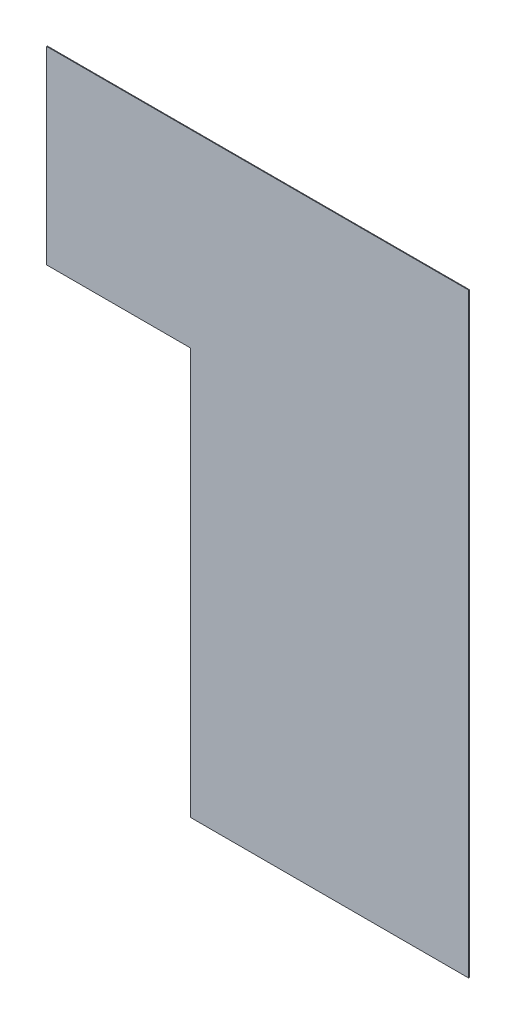
ISO-10303-21;
HEADER;
FILE_DESCRIPTION(('STEP AP214'),'2;1');
FILE_NAME('part.step','',(''),(''),'','','');
FILE_SCHEMA(('AUTOMOTIVE_DESIGN { 1 0 10303 214 1 1 1 1 }'));
ENDSEC;
DATA;
#1=APPLICATION_CONTEXT('core data for automotive mechanical design processes');
#2=APPLICATION_PROTOCOL_DEFINITION('international standard','automotive_design',2000,#1);
#3=PRODUCT_CONTEXT('',#1,'mechanical');
#4=PRODUCT('Part','Part','',(#3));
#5=PRODUCT_RELATED_PRODUCT_CATEGORY('part','',(#4));
#6=PRODUCT_DEFINITION_FORMATION('','',#4);
#7=PRODUCT_DEFINITION_CONTEXT('part definition',#1,'design');
#8=PRODUCT_DEFINITION('design','',#6,#7);
#9=PRODUCT_DEFINITION_SHAPE('','',#8);
#10=(LENGTH_UNIT() NAMED_UNIT(*) SI_UNIT(.MILLI.,.METRE.));
#11=(NAMED_UNIT(*) PLANE_ANGLE_UNIT() SI_UNIT($,.RADIAN.));
#12=(NAMED_UNIT(*) SI_UNIT($,.STERADIAN.) SOLID_ANGLE_UNIT());
#13=UNCERTAINTY_MEASURE_WITH_UNIT(LENGTH_MEASURE(1.E-05),#10,'distance_accuracy_value','');
#14=(GEOMETRIC_REPRESENTATION_CONTEXT(3) GLOBAL_UNCERTAINTY_ASSIGNED_CONTEXT((#13)) GLOBAL_UNIT_ASSIGNED_CONTEXT((#10,
#11,#12)) REPRESENTATION_CONTEXT('',''));
#15=CARTESIAN_POINT('',(0.,0.,0.));
#16=DIRECTION('',(0.,0.,1.));
#17=DIRECTION('',(1.,0.,0.));
#18=AXIS2_PLACEMENT_3D('',#15,#16,#17);
#19=CARTESIAN_POINT('',(0.,0.,42245.2208429728));
#20=DIRECTION('',(0.,0.,-1.));
#21=DIRECTION('',(-1.,0.,0.));
#22=AXIS2_PLACEMENT_3D('',#19,#20,#21);
#23=PLANE('',#22);
#24=DIRECTION('',(0.,-1.,0.));
#25=VECTOR('',#24,1.);
#26=CARTESIAN_POINT('',(-7996.61768329129,14737.077366586,42245.2208429728));
#27=LINE('',#26,#25);
#28=CARTESIAN_POINT('',(-7996.61768329129,19917.481366586,42245.2208429728));
#29=VERTEX_POINT('',#28);
#30=CARTESIAN_POINT('',(-7996.61768329129,3607.48136658604,42245.2208429728));
#31=VERTEX_POINT('',#30);
#32=EDGE_CURVE('E181',#29,#31,#27,.T.);
#33=ORIENTED_EDGE('',*,*,#32,.F.);
#34=DIRECTION('',(-1.,0.,0.));
#35=VECTOR('',#34,1.);
#36=CARTESIAN_POINT('',(-7996.61768329129,19917.481366586,42245.2208429728));
#37=LINE('',#36,#35);
#38=CARTESIAN_POINT('',(-19546.6176832913,19917.481366586,42245.2208429728));
#39=VERTEX_POINT('',#38);
#40=EDGE_CURVE('E128',#29,#39,#37,.T.);
#41=ORIENTED_EDGE('',*,*,#40,.T.);
#42=DIRECTION('',(0.,-1.,0.));
#43=VECTOR('',#42,1.);
#44=CARTESIAN_POINT('',(-19546.6176832913,19917.481366586,42245.2208429728));
#45=LINE('',#44,#43);
#46=CARTESIAN_POINT('',(-19546.6176832913,14737.077366586,42245.2208429728));
#47=VERTEX_POINT('',#46);
#48=EDGE_CURVE('E137',#39,#47,#45,.T.);
#49=ORIENTED_EDGE('',*,*,#48,.T.);
#50=DIRECTION('',(-1.,0.,0.));
#51=VECTOR('',#50,1.);
#52=CARTESIAN_POINT('',(-7996.61768329129,14737.077366586,42245.2208429728));
#53=LINE('',#52,#51);
#54=CARTESIAN_POINT('',(-15606.6176832913,14737.077366586,42245.2208429728));
#55=VERTEX_POINT('',#54);
#56=EDGE_CURVE('E135',#55,#47,#53,.T.);
#57=ORIENTED_EDGE('',*,*,#56,.F.);
#58=DIRECTION('',(0.,-1.,0.));
#59=VECTOR('',#58,1.);
#60=CARTESIAN_POINT('',(-15606.6176832913,14737.077366586,42245.2208429728));
#61=LINE('',#60,#59);
#62=CARTESIAN_POINT('',(-15606.6176832913,3607.48136658604,42245.2208429728));
#63=VERTEX_POINT('',#62);
#64=EDGE_CURVE('E187',#55,#63,#61,.T.);
#65=ORIENTED_EDGE('',*,*,#64,.T.);
#66=DIRECTION('',(-1.,0.,0.));
#67=VECTOR('',#66,1.);
#68=CARTESIAN_POINT('',(-7996.61768329129,3607.48136658604,42245.2208429728));
#69=LINE('',#68,#67);
#70=EDGE_CURVE('E188',#31,#63,#69,.T.);
#71=ORIENTED_EDGE('',*,*,#70,.F.);
#72=EDGE_LOOP('',(#33,#41,#49,#57,#65,#71));
#73=FACE_BOUND('',#72,.T.);
#74=ADVANCED_FACE('F61',(#73),#23,.F.);
#75=CARTESIAN_POINT('',(-7996.61768329129,3607.48136658604,42245.2208429728));
#76=DIRECTION('',(0.,-1.,0.));
#77=DIRECTION('',(0.,0.,-1.));
#78=AXIS2_PLACEMENT_3D('',#75,#76,#77);
#79=PLANE('',#78);
#80=DIRECTION('',(-1.,0.,0.));
#81=VECTOR('',#80,1.);
#82=CARTESIAN_POINT('',(-7996.61768329129,3607.48136658604,42225.2208429728));
#83=LINE('',#82,#81);
#84=CARTESIAN_POINT('',(-7996.61768329129,3607.48136658604,42225.2208429728));
#85=VERTEX_POINT('',#84);
#86=CARTESIAN_POINT('',(-15606.6176832913,3607.48136658604,42225.2208429728));
#87=VERTEX_POINT('',#86);
#88=EDGE_CURVE('E125',#85,#87,#83,.T.);
#89=ORIENTED_EDGE('',*,*,#88,.F.);
#90=DIRECTION('',(0.,0.,-1.));
#91=VECTOR('',#90,1.);
#92=CARTESIAN_POINT('',(-7996.61768329129,3607.48136658604,42245.2208429728));
#93=LINE('',#92,#91);
#94=EDGE_CURVE('E121',#31,#85,#93,.T.);
#95=ORIENTED_EDGE('',*,*,#94,.F.);
#96=ORIENTED_EDGE('',*,*,#70,.T.);
#97=DIRECTION('',(0.,0.,-1.));
#98=VECTOR('',#97,1.);
#99=CARTESIAN_POINT('',(-15606.6176832913,3607.48136658604,42245.2208429728));
#100=LINE('',#99,#98);
#101=EDGE_CURVE('E71',#63,#87,#100,.T.);
#102=ORIENTED_EDGE('',*,*,#101,.T.);
#103=EDGE_LOOP('',(#89,#95,#96,#102));
#104=FACE_BOUND('',#103,.T.);
#105=ADVANCED_FACE('F164',(#104),#79,.T.);
#106=CARTESIAN_POINT('',(0.,0.,42225.2208429728));
#107=DIRECTION('',(0.,0.,-1.));
#108=DIRECTION('',(-1.,0.,0.));
#109=AXIS2_PLACEMENT_3D('',#106,#107,#108);
#110=PLANE('',#109);
#111=DIRECTION('',(0.,-1.,0.));
#112=VECTOR('',#111,1.);
#113=CARTESIAN_POINT('',(-7996.61768329129,14737.077366586,42225.2208429728));
#114=LINE('',#113,#112);
#115=CARTESIAN_POINT('',(-7996.61768329129,19917.481366586,42225.2208429728));
#116=VERTEX_POINT('',#115);
#117=EDGE_CURVE('E115',#116,#85,#114,.T.);
#118=ORIENTED_EDGE('',*,*,#117,.T.);
#119=ORIENTED_EDGE('',*,*,#88,.T.);
#120=DIRECTION('',(0.,-1.,0.));
#121=VECTOR('',#120,1.);
#122=CARTESIAN_POINT('',(-15606.6176832913,14737.077366586,42225.2208429728));
#123=LINE('',#122,#121);
#124=CARTESIAN_POINT('',(-15606.6176832913,14737.077366586,42225.2208429728));
#125=VERTEX_POINT('',#124);
#126=EDGE_CURVE('E152',#125,#87,#123,.T.);
#127=ORIENTED_EDGE('',*,*,#126,.F.);
#128=DIRECTION('',(-1.,0.,0.));
#129=VECTOR('',#128,1.);
#130=CARTESIAN_POINT('',(-7996.61768329129,14737.077366586,42225.2208429728));
#131=LINE('',#130,#129);
#132=CARTESIAN_POINT('',(-19546.6176832913,14737.077366586,42225.2208429728));
#133=VERTEX_POINT('',#132);
#134=EDGE_CURVE('E139',#125,#133,#131,.T.);
#135=ORIENTED_EDGE('',*,*,#134,.T.);
#136=DIRECTION('',(0.,-1.,0.));
#137=VECTOR('',#136,1.);
#138=CARTESIAN_POINT('',(-19546.6176832913,19917.481366586,42225.2208429728));
#139=LINE('',#138,#137);
#140=CARTESIAN_POINT('',(-19546.6176832913,19917.481366586,42225.2208429728));
#141=VERTEX_POINT('',#140);
#142=EDGE_CURVE('E134',#141,#133,#139,.T.);
#143=ORIENTED_EDGE('',*,*,#142,.F.);
#144=DIRECTION('',(-1.,0.,0.));
#145=VECTOR('',#144,1.);
#146=CARTESIAN_POINT('',(-7996.61768329129,19917.481366586,42225.2208429728));
#147=LINE('',#146,#145);
#148=EDGE_CURVE('E109',#116,#141,#147,.T.);
#149=ORIENTED_EDGE('',*,*,#148,.F.);
#150=EDGE_LOOP('',(#118,#119,#127,#135,#143,#149));
#151=FACE_BOUND('',#150,.T.);
#152=ADVANCED_FACE('F132',(#151),#110,.T.);
#153=CARTESIAN_POINT('',(-15606.6176832913,14737.077366586,42245.2208429728));
#154=DIRECTION('',(1.,0.,0.));
#155=DIRECTION('',(0.,1.,0.));
#156=AXIS2_PLACEMENT_3D('',#153,#154,#155);
#157=PLANE('',#156);
#158=ORIENTED_EDGE('',*,*,#126,.T.);
#159=ORIENTED_EDGE('',*,*,#101,.F.);
#160=ORIENTED_EDGE('',*,*,#64,.F.);
#161=DIRECTION('',(0.,0.,-1.));
#162=VECTOR('',#161,1.);
#163=CARTESIAN_POINT('',(-15606.6176832913,14737.077366586,42245.2208429728));
#164=LINE('',#163,#162);
#165=EDGE_CURVE('E12',#55,#125,#164,.T.);
#166=ORIENTED_EDGE('',*,*,#165,.T.);
#167=EDGE_LOOP('',(#158,#159,#160,#166));
#168=FACE_BOUND('',#167,.T.);
#169=ADVANCED_FACE('F161',(#168),#157,.F.);
#170=CARTESIAN_POINT('',(-7996.61768329129,14737.077366586,42245.2208429728));
#171=DIRECTION('',(1.,0.,0.));
#172=DIRECTION('',(0.,1.,0.));
#173=AXIS2_PLACEMENT_3D('',#170,#171,#172);
#174=PLANE('',#173);
#175=ORIENTED_EDGE('',*,*,#117,.F.);
#176=DIRECTION('',(0.,0.,-1.));
#177=VECTOR('',#176,1.);
#178=CARTESIAN_POINT('',(-7996.61768329129,19917.481366586,42245.2208429728));
#179=LINE('',#178,#177);
#180=EDGE_CURVE('E118',#29,#116,#179,.T.);
#181=ORIENTED_EDGE('',*,*,#180,.F.);
#182=ORIENTED_EDGE('',*,*,#32,.T.);
#183=ORIENTED_EDGE('',*,*,#94,.T.);
#184=EDGE_LOOP('',(#175,#181,#182,#183));
#185=FACE_BOUND('',#184,.T.);
#186=ADVANCED_FACE('F116',(#185),#174,.T.);
#187=CARTESIAN_POINT('',(-7996.61768329129,19917.481366586,42245.2208429728));
#188=DIRECTION('',(0.,-1.,0.));
#189=DIRECTION('',(0.,0.,-1.));
#190=AXIS2_PLACEMENT_3D('',#187,#188,#189);
#191=PLANE('',#190);
#192=ORIENTED_EDGE('',*,*,#148,.T.);
#193=DIRECTION('',(0.,0.,-1.));
#194=VECTOR('',#193,1.);
#195=CARTESIAN_POINT('',(-19546.6176832913,19917.481366586,42245.2208429728));
#196=LINE('',#195,#194);
#197=EDGE_CURVE('E129',#39,#141,#196,.T.);
#198=ORIENTED_EDGE('',*,*,#197,.F.);
#199=ORIENTED_EDGE('',*,*,#40,.F.);
#200=ORIENTED_EDGE('',*,*,#180,.T.);
#201=EDGE_LOOP('',(#192,#198,#199,#200));
#202=FACE_BOUND('',#201,.T.);
#203=ADVANCED_FACE('F127',(#202),#191,.F.);
#204=CARTESIAN_POINT('',(-19546.6176832913,19917.481366586,42245.2208429728));
#205=DIRECTION('',(1.,0.,0.));
#206=DIRECTION('',(0.,0.,-1.));
#207=AXIS2_PLACEMENT_3D('',#204,#205,#206);
#208=PLANE('',#207);
#209=ORIENTED_EDGE('',*,*,#142,.T.);
#210=DIRECTION('',(0.,0.,-1.));
#211=VECTOR('',#210,1.);
#212=CARTESIAN_POINT('',(-19546.6176832913,14737.077366586,42245.2208429728));
#213=LINE('',#212,#211);
#214=EDGE_CURVE('E65',#47,#133,#213,.T.);
#215=ORIENTED_EDGE('',*,*,#214,.F.);
#216=ORIENTED_EDGE('',*,*,#48,.F.);
#217=ORIENTED_EDGE('',*,*,#197,.T.);
#218=EDGE_LOOP('',(#209,#215,#216,#217));
#219=FACE_BOUND('',#218,.T.);
#220=ADVANCED_FACE('F154',(#219),#208,.F.);
#221=CARTESIAN_POINT('',(-7996.61768329129,14737.077366586,42245.2208429728));
#222=DIRECTION('',(0.,-1.,0.));
#223=DIRECTION('',(0.,0.,-1.));
#224=AXIS2_PLACEMENT_3D('',#221,#222,#223);
#225=PLANE('',#224);
#226=ORIENTED_EDGE('',*,*,#165,.F.);
#227=ORIENTED_EDGE('',*,*,#56,.T.);
#228=ORIENTED_EDGE('',*,*,#214,.T.);
#229=ORIENTED_EDGE('',*,*,#134,.F.);
#230=EDGE_LOOP('',(#226,#227,#228,#229));
#231=FACE_BOUND('',#230,.T.);
#232=ADVANCED_FACE('F63',(#231),#225,.T.);
#233=CLOSED_SHELL('',(#74,#105,#152,#169,#186,#203,#220,#232));
#234=MANIFOLD_SOLID_BREP('B2',#233);
#235=ADVANCED_BREP_SHAPE_REPRESENTATION('',(#18,#234),#14);
#236=SHAPE_DEFINITION_REPRESENTATION(#9,#235);
ENDSEC;
END-ISO-10303-21;
